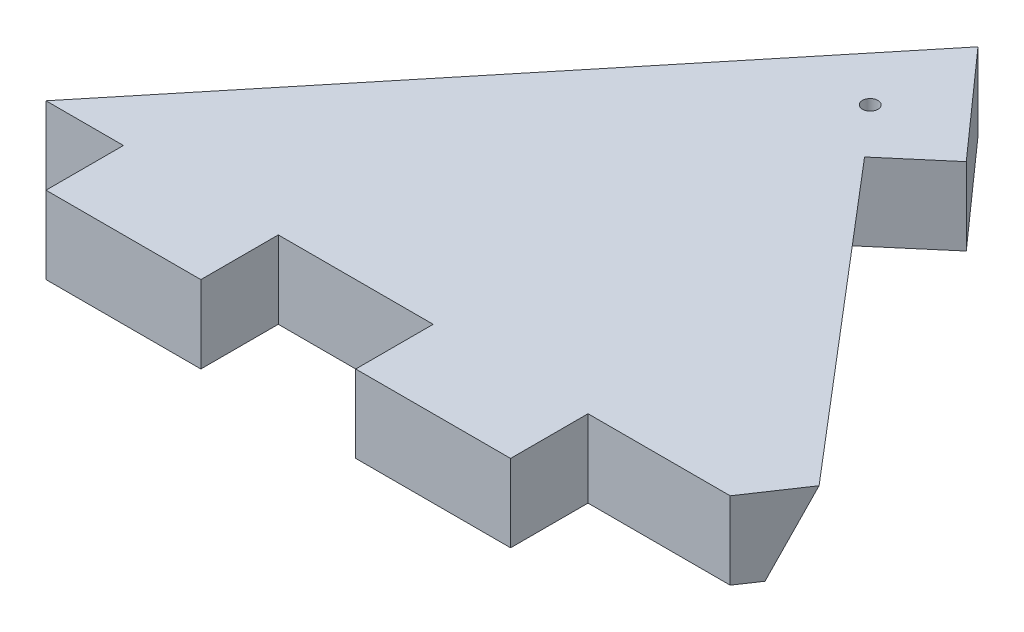
ISO-10303-21;
HEADER;
FILE_DESCRIPTION(('STEP AP214'),'2;1');
FILE_NAME('part.step','',(''),(''),'','','');
FILE_SCHEMA(('AUTOMOTIVE_DESIGN { 1 0 10303 214 1 1 1 1 }'));
ENDSEC;
DATA;
#1=APPLICATION_CONTEXT('core data for automotive mechanical design processes');
#2=APPLICATION_PROTOCOL_DEFINITION('international standard','automotive_design',2000,#1);
#3=PRODUCT_CONTEXT('',#1,'mechanical');
#4=PRODUCT('Part','Part','',(#3));
#5=PRODUCT_RELATED_PRODUCT_CATEGORY('part','',(#4));
#6=PRODUCT_DEFINITION_FORMATION('','',#4);
#7=PRODUCT_DEFINITION_CONTEXT('part definition',#1,'design');
#8=PRODUCT_DEFINITION('design','',#6,#7);
#9=PRODUCT_DEFINITION_SHAPE('','',#8);
#10=(LENGTH_UNIT() NAMED_UNIT(*) SI_UNIT(.MILLI.,.METRE.));
#11=(NAMED_UNIT(*) PLANE_ANGLE_UNIT() SI_UNIT($,.RADIAN.));
#12=(NAMED_UNIT(*) SI_UNIT($,.STERADIAN.) SOLID_ANGLE_UNIT());
#13=UNCERTAINTY_MEASURE_WITH_UNIT(LENGTH_MEASURE(1.E-05),#10,'distance_accuracy_value','');
#14=(GEOMETRIC_REPRESENTATION_CONTEXT(3) GLOBAL_UNCERTAINTY_ASSIGNED_CONTEXT((#13)) GLOBAL_UNIT_ASSIGNED_CONTEXT((#10,
#11,#12)) REPRESENTATION_CONTEXT('',''));
#15=CARTESIAN_POINT('',(0.,0.,0.));
#16=DIRECTION('',(0.,0.,1.));
#17=DIRECTION('',(1.,0.,0.));
#18=AXIS2_PLACEMENT_3D('',#15,#16,#17);
#19=CARTESIAN_POINT('',(10.0000000000253,0.,-10.));
#20=DIRECTION('',(0.,1.,0.));
#21=DIRECTION('',(0.,0.,1.));
#22=AXIS2_PLACEMENT_3D('',#19,#20,#21);
#23=PLANE('',#22);
#24=CARTESIAN_POINT('',(53.6755951689133,0.,-62.7666643876784));
#25=DIRECTION('',(0.,1.,0.));
#26=DIRECTION('',(0.,0.,1.));
#27=AXIS2_PLACEMENT_3D('',#24,#25,#26);
#28=CIRCLE('',#27,1.);
#29=CARTESIAN_POINT('',(53.6755951689133,0.,-61.7666643876784));
#30=VERTEX_POINT('',#29);
#31=EDGE_CURVE('E164',#30,#30,#28,.T.);
#32=ORIENTED_EDGE('',*,*,#31,.T.);
#33=EDGE_LOOP('',(#32));
#34=FACE_BOUND('',#33,.T.);
#35=DIRECTION('',(0.761174189576516,0.,-0.648547494885714));
#36=VECTOR('',#35,1.);
#37=CARTESIAN_POINT('',(7.67912276747319,0.,-12.7239205463367));
#38=LINE('',#37,#36);
#39=CARTESIAN_POINT('',(55.4526894768892,0.,-53.4286993412997));
#40=VERTEX_POINT('',#39);
#41=CARTESIAN_POINT('',(66.2340107176788,0.,-62.6147686773638));
#42=VERTEX_POINT('',#41);
#43=EDGE_CURVE('E143',#40,#42,#38,.T.);
#44=ORIENTED_EDGE('',*,*,#43,.F.);
#45=DIRECTION('',(-0.648547494885713,0.,-0.761174189576516));
#46=VECTOR('',#45,1.);
#47=CARTESIAN_POINT('',(57.7735667094413,0.,-50.704778794963));
#48=LINE('',#47,#46);
#49=CARTESIAN_POINT('',(90.1660580755618,0.,-12.6870105383514));
#50=VERTEX_POINT('',#49);
#51=EDGE_CURVE('E154',#50,#40,#48,.T.);
#52=ORIENTED_EDGE('',*,*,#51,.F.);
#53=DIRECTION('',(0.557648764486582,0.,-0.830077017792078));
#54=VECTOR('',#53,1.);
#55=CARTESIAN_POINT('',(88.3609146072369,0.,-10.0000000000001));
#56=LINE('',#55,#54);
#57=CARTESIAN_POINT('',(88.3609146072369,0.,-10.0000000000001));
#58=VERTEX_POINT('',#57);
#59=EDGE_CURVE('E172',#58,#50,#56,.T.);
#60=ORIENTED_EDGE('',*,*,#59,.F.);
#61=DIRECTION('',(-1.,0.,0.));
#62=VECTOR('',#61,1.);
#63=CARTESIAN_POINT('',(70.0000000000252,0.,-10.));
#64=LINE('',#63,#62);
#65=CARTESIAN_POINT('',(70.0000000000252,0.,-10.));
#66=VERTEX_POINT('',#65);
#67=EDGE_CURVE('E179',#58,#66,#64,.T.);
#68=ORIENTED_EDGE('',*,*,#67,.T.);
#69=DIRECTION('',(0.,0.,1.));
#70=VECTOR('',#69,1.);
#71=CARTESIAN_POINT('',(70.0000000000252,0.,-10.));
#72=LINE('',#71,#70);
#73=CARTESIAN_POINT('',(70.0000000000252,0.,0.));
#74=VERTEX_POINT('',#73);
#75=EDGE_CURVE('E208',#66,#74,#72,.T.);
#76=ORIENTED_EDGE('',*,*,#75,.T.);
#77=DIRECTION('',(-1.,0.,0.));
#78=VECTOR('',#77,1.);
#79=CARTESIAN_POINT('',(50.0000000000251,0.,0.));
#80=LINE('',#79,#78);
#81=CARTESIAN_POINT('',(50.0000000000251,0.,0.));
#82=VERTEX_POINT('',#81);
#83=EDGE_CURVE('E215',#74,#82,#80,.T.);
#84=ORIENTED_EDGE('',*,*,#83,.T.);
#85=DIRECTION('',(0.,0.,-1.));
#86=VECTOR('',#85,1.);
#87=CARTESIAN_POINT('',(50.0000000000251,0.,-10.));
#88=LINE('',#87,#86);
#89=CARTESIAN_POINT('',(50.0000000000251,0.,-10.));
#90=VERTEX_POINT('',#89);
#91=EDGE_CURVE('E220',#82,#90,#88,.T.);
#92=ORIENTED_EDGE('',*,*,#91,.T.);
#93=DIRECTION('',(-1.,0.,0.));
#94=VECTOR('',#93,1.);
#95=CARTESIAN_POINT('',(30.0000000000251,0.,-10.));
#96=LINE('',#95,#94);
#97=CARTESIAN_POINT('',(30.0000000000251,0.,-10.));
#98=VERTEX_POINT('',#97);
#99=EDGE_CURVE('E225',#90,#98,#96,.T.);
#100=ORIENTED_EDGE('',*,*,#99,.T.);
#101=DIRECTION('',(0.,0.,1.));
#102=VECTOR('',#101,1.);
#103=CARTESIAN_POINT('',(30.0000000000251,0.,0.));
#104=LINE('',#103,#102);
#105=CARTESIAN_POINT('',(30.0000000000251,0.,0.));
#106=VERTEX_POINT('',#105);
#107=EDGE_CURVE('E230',#98,#106,#104,.T.);
#108=ORIENTED_EDGE('',*,*,#107,.T.);
#109=DIRECTION('',(-1.,0.,0.));
#110=VECTOR('',#109,1.);
#111=CARTESIAN_POINT('',(10.0000000000252,0.,0.));
#112=LINE('',#111,#110);
#113=CARTESIAN_POINT('',(10.0000000000252,0.,0.));
#114=VERTEX_POINT('',#113);
#115=EDGE_CURVE('E235',#106,#114,#112,.T.);
#116=ORIENTED_EDGE('',*,*,#115,.T.);
#117=DIRECTION('',(0.,0.,-1.));
#118=VECTOR('',#117,1.);
#119=CARTESIAN_POINT('',(10.0000000000252,0.,0.));
#120=LINE('',#119,#118);
#121=CARTESIAN_POINT('',(10.0000000000253,0.,-10.));
#122=VERTEX_POINT('',#121);
#123=EDGE_CURVE('E240',#114,#122,#120,.T.);
#124=ORIENTED_EDGE('',*,*,#123,.T.);
#125=DIRECTION('',(-1.,0.,0.));
#126=VECTOR('',#125,1.);
#127=CARTESIAN_POINT('',(10.0000000000253,0.,-10.));
#128=LINE('',#127,#126);
#129=CARTESIAN_POINT('',(0.,0.,-10.));
#130=VERTEX_POINT('',#129);
#131=EDGE_CURVE('E245',#122,#130,#128,.T.);
#132=ORIENTED_EDGE('',*,*,#131,.T.);
#133=DIRECTION('',(0.632989399422861,0.,-0.774160461544172));
#134=VECTOR('',#133,1.);
#135=CARTESIAN_POINT('',(0.,0.,-10.));
#136=LINE('',#135,#134);
#137=CARTESIAN_POINT('',(54.1439023072188,0.,-76.2192264802171));
#138=VERTEX_POINT('',#137);
#139=EDGE_CURVE('E116',#130,#138,#136,.T.);
#140=ORIENTED_EDGE('',*,*,#139,.T.);
#141=DIRECTION('',(-0.664279644946327,0.,-0.747484149203167));
#142=VECTOR('',#141,1.);
#143=CARTESIAN_POINT('',(54.1439023072188,0.,-76.2192264802171));
#144=LINE('',#143,#142);
#145=EDGE_CURVE('E124',#42,#138,#144,.T.);
#146=ORIENTED_EDGE('',*,*,#145,.F.);
#147=EDGE_LOOP('',(#44,#52,#60,#68,#76,#84,#92,#100,#108,#116,#124,#132,#140,#146));
#148=FACE_BOUND('',#147,.T.);
#149=ADVANCED_FACE('F35',(#34,#148),#23,.F.);
#150=CARTESIAN_POINT('',(10.0000000000253,10.,-10.));
#151=DIRECTION('',(0.,1.,0.));
#152=DIRECTION('',(0.,0.,1.));
#153=AXIS2_PLACEMENT_3D('',#150,#151,#152);
#154=PLANE('',#153);
#155=CARTESIAN_POINT('',(53.6755951689133,10.,-62.7666643876784));
#156=DIRECTION('',(0.,1.,0.));
#157=DIRECTION('',(0.,0.,1.));
#158=AXIS2_PLACEMENT_3D('',#155,#156,#157);
#159=CIRCLE('',#158,0.999999999999987);
#160=CARTESIAN_POINT('',(53.6755951689133,10.,-61.7666643876784));
#161=VERTEX_POINT('',#160);
#162=EDGE_CURVE('E259',#161,#161,#159,.T.);
#163=ORIENTED_EDGE('',*,*,#162,.F.);
#164=EDGE_LOOP('',(#163));
#165=FACE_BOUND('',#164,.T.);
#166=DIRECTION('',(-0.648547494885713,0.,-0.761174189576516));
#167=VECTOR('',#166,1.);
#168=CARTESIAN_POINT('',(61.4621572570691,10.,-53.8475891951081));
#169=LINE('',#168,#167);
#170=CARTESIAN_POINT('',(92.972755186172,10.,-16.8648639037506));
#171=VERTEX_POINT('',#170);
#172=CARTESIAN_POINT('',(59.141280024517,10.,-56.5715097414448));
#173=VERTEX_POINT('',#172);
#174=EDGE_CURVE('E49',#171,#173,#169,.T.);
#175=ORIENTED_EDGE('',*,*,#174,.T.);
#176=DIRECTION('',(0.761174189576516,0.,-0.648547494885714));
#177=VECTOR('',#176,1.);
#178=CARTESIAN_POINT('',(7.67912276747319,10.,-12.7239205463367));
#179=LINE('',#178,#177);
#180=CARTESIAN_POINT('',(66.2340107176788,10.,-62.6147686773638));
#181=VERTEX_POINT('',#180);
#182=EDGE_CURVE('E160',#173,#181,#179,.T.);
#183=ORIENTED_EDGE('',*,*,#182,.T.);
#184=DIRECTION('',(-0.664279644946327,0.,-0.747484149203167));
#185=VECTOR('',#184,1.);
#186=CARTESIAN_POINT('',(54.1439023072188,10.,-76.2192264802171));
#187=LINE('',#186,#185);
#188=CARTESIAN_POINT('',(54.1439023072188,10.,-76.2192264802171));
#189=VERTEX_POINT('',#188);
#190=EDGE_CURVE('E168',#181,#189,#187,.T.);
#191=ORIENTED_EDGE('',*,*,#190,.T.);
#192=DIRECTION('',(-0.632989399422861,0.,0.774160461544172));
#193=VECTOR('',#192,1.);
#194=CARTESIAN_POINT('',(37.4699620492831,10.,-55.826617539826));
#195=LINE('',#194,#193);
#196=CARTESIAN_POINT('',(0.,10.,-10.));
#197=VERTEX_POINT('',#196);
#198=EDGE_CURVE('E205',#189,#197,#195,.T.);
#199=ORIENTED_EDGE('',*,*,#198,.T.);
#200=DIRECTION('',(1.,0.,0.));
#201=VECTOR('',#200,1.);
#202=CARTESIAN_POINT('',(10.0000000000253,10.,-10.));
#203=LINE('',#202,#201);
#204=CARTESIAN_POINT('',(10.0000000000253,10.,-10.));
#205=VERTEX_POINT('',#204);
#206=EDGE_CURVE('E202',#197,#205,#203,.T.);
#207=ORIENTED_EDGE('',*,*,#206,.T.);
#208=DIRECTION('',(0.,0.,1.));
#209=VECTOR('',#208,1.);
#210=CARTESIAN_POINT('',(10.0000000000253,10.,-10.));
#211=LINE('',#210,#209);
#212=CARTESIAN_POINT('',(10.0000000000252,10.,0.));
#213=VERTEX_POINT('',#212);
#214=EDGE_CURVE('E199',#205,#213,#211,.T.);
#215=ORIENTED_EDGE('',*,*,#214,.T.);
#216=DIRECTION('',(1.,0.,0.));
#217=VECTOR('',#216,1.);
#218=CARTESIAN_POINT('',(10.0000000000253,10.,0.));
#219=LINE('',#218,#217);
#220=CARTESIAN_POINT('',(30.0000000000251,10.,0.));
#221=VERTEX_POINT('',#220);
#222=EDGE_CURVE('E196',#213,#221,#219,.T.);
#223=ORIENTED_EDGE('',*,*,#222,.T.);
#224=DIRECTION('',(0.,0.,1.));
#225=VECTOR('',#224,1.);
#226=CARTESIAN_POINT('',(30.0000000000251,10.,-10.));
#227=LINE('',#226,#225);
#228=CARTESIAN_POINT('',(30.0000000000251,10.,-10.));
#229=VERTEX_POINT('',#228);
#230=EDGE_CURVE('E193',#221,#229,#227,.F.);
#231=ORIENTED_EDGE('',*,*,#230,.T.);
#232=DIRECTION('',(1.,0.,0.));
#233=VECTOR('',#232,1.);
#234=CARTESIAN_POINT('',(10.0000000000253,10.,-10.));
#235=LINE('',#234,#233);
#236=CARTESIAN_POINT('',(50.0000000000251,10.,-10.));
#237=VERTEX_POINT('',#236);
#238=EDGE_CURVE('E190',#229,#237,#235,.T.);
#239=ORIENTED_EDGE('',*,*,#238,.T.);
#240=DIRECTION('',(0.,0.,1.));
#241=VECTOR('',#240,1.);
#242=CARTESIAN_POINT('',(50.0000000000251,10.,-10.));
#243=LINE('',#242,#241);
#244=CARTESIAN_POINT('',(50.0000000000251,10.,0.));
#245=VERTEX_POINT('',#244);
#246=EDGE_CURVE('E187',#237,#245,#243,.T.);
#247=ORIENTED_EDGE('',*,*,#246,.T.);
#248=DIRECTION('',(1.,0.,0.));
#249=VECTOR('',#248,1.);
#250=CARTESIAN_POINT('',(10.0000000000253,10.,0.));
#251=LINE('',#250,#249);
#252=CARTESIAN_POINT('',(70.0000000000252,10.,0.));
#253=VERTEX_POINT('',#252);
#254=EDGE_CURVE('E184',#245,#253,#251,.T.);
#255=ORIENTED_EDGE('',*,*,#254,.T.);
#256=DIRECTION('',(0.,0.,1.));
#257=VECTOR('',#256,1.);
#258=CARTESIAN_POINT('',(70.0000000000252,10.,-10.));
#259=LINE('',#258,#257);
#260=CARTESIAN_POINT('',(70.0000000000252,10.,-10.));
#261=VERTEX_POINT('',#260);
#262=EDGE_CURVE('E182',#253,#261,#259,.F.);
#263=ORIENTED_EDGE('',*,*,#262,.T.);
#264=DIRECTION('',(1.,0.,0.));
#265=VECTOR('',#264,1.);
#266=CARTESIAN_POINT('',(10.0000000000253,10.,-10.));
#267=LINE('',#266,#265);
#268=CARTESIAN_POINT('',(88.3609146072369,10.,-10.0000000000001));
#269=VERTEX_POINT('',#268);
#270=EDGE_CURVE('E134',#261,#269,#267,.T.);
#271=ORIENTED_EDGE('',*,*,#270,.T.);
#272=DIRECTION('',(0.557648764486585,0.,-0.830077017792075));
#273=VECTOR('',#272,1.);
#274=CARTESIAN_POINT('',(98.9648279903557,10.,-25.784245135177));
#275=LINE('',#274,#273);
#276=EDGE_CURVE('E166',#269,#171,#275,.T.);
#277=ORIENTED_EDGE('',*,*,#276,.T.);
#278=EDGE_LOOP('',(#175,#183,#191,#199,#207,#215,#223,#231,#239,#247,#255,#263,#271,#277));
#279=FACE_BOUND('',#278,.T.);
#280=ADVANCED_FACE('F253',(#165,#279),#154,.T.);
#281=CARTESIAN_POINT('',(54.1439023072188,0.,-76.2192264802171));
#282=DIRECTION('',(0.747484149203167,0.,-0.664279644946327));
#283=DIRECTION('',(-0.664279644946327,0.,-0.747484149203167));
#284=AXIS2_PLACEMENT_3D('',#281,#282,#283);
#285=PLANE('',#284);
#286=ORIENTED_EDGE('',*,*,#190,.F.);
#287=DIRECTION('',(0.,-1.,0.));
#288=VECTOR('',#287,1.);
#289=CARTESIAN_POINT('',(66.2340107176788,0.,-62.6147686773638));
#290=LINE('',#289,#288);
#291=EDGE_CURVE('E11',#181,#42,#290,.T.);
#292=ORIENTED_EDGE('',*,*,#291,.T.);
#293=ORIENTED_EDGE('',*,*,#145,.T.);
#294=DIRECTION('',(0.,1.,0.));
#295=VECTOR('',#294,1.);
#296=CARTESIAN_POINT('',(54.1439023072188,0.,-76.2192264802171));
#297=LINE('',#296,#295);
#298=EDGE_CURVE('E177',#138,#189,#297,.T.);
#299=ORIENTED_EDGE('',*,*,#298,.T.);
#300=EDGE_LOOP('',(#286,#292,#293,#299));
#301=FACE_BOUND('',#300,.T.);
#302=ADVANCED_FACE('F266',(#301),#285,.T.);
#303=CARTESIAN_POINT('',(98.9648279903557,0.,-25.784245135177));
#304=DIRECTION('',(0.830077017792075,0.,0.557648764486585));
#305=DIRECTION('',(0.557648764486585,0.,-0.830077017792075));
#306=AXIS2_PLACEMENT_3D('',#303,#304,#305);
#307=PLANE('',#306);
#308=ORIENTED_EDGE('',*,*,#59,.T.);
#309=DIRECTION('',(0.250705897184406,0.893241726143702,-0.37318329516845));
#310=VECTOR('',#309,1.);
#311=CARTESIAN_POINT('',(91.9444585760482,6.33627509631693,-15.3342133618757));
#312=LINE('',#311,#310);
#313=EDGE_CURVE('E42',#50,#171,#312,.T.);
#314=ORIENTED_EDGE('',*,*,#313,.T.);
#315=ORIENTED_EDGE('',*,*,#276,.F.);
#316=DIRECTION('',(0.,1.,0.));
#317=VECTOR('',#316,1.);
#318=CARTESIAN_POINT('',(88.3609146072369,0.,-10.0000000000001));
#319=LINE('',#318,#317);
#320=EDGE_CURVE('E174',#58,#269,#319,.T.);
#321=ORIENTED_EDGE('',*,*,#320,.F.);
#322=EDGE_LOOP('',(#308,#314,#315,#321));
#323=FACE_BOUND('',#322,.T.);
#324=ADVANCED_FACE('F251',(#323),#307,.T.);
#325=CARTESIAN_POINT('',(70.0000000000252,10.,-10.));
#326=DIRECTION('',(0.,0.,-1.));
#327=DIRECTION('',(-1.,0.,0.));
#328=AXIS2_PLACEMENT_3D('',#325,#326,#327);
#329=PLANE('',#328);
#330=ORIENTED_EDGE('',*,*,#67,.F.);
#331=ORIENTED_EDGE('',*,*,#320,.T.);
#332=ORIENTED_EDGE('',*,*,#270,.F.);
#333=DIRECTION('',(0.,1.,0.));
#334=VECTOR('',#333,1.);
#335=CARTESIAN_POINT('',(70.0000000000252,10.,-10.));
#336=LINE('',#335,#334);
#337=EDGE_CURVE('E211',#261,#66,#336,.F.);
#338=ORIENTED_EDGE('',*,*,#337,.T.);
#339=EDGE_LOOP('',(#330,#331,#332,#338));
#340=FACE_BOUND('',#339,.T.);
#341=ADVANCED_FACE('F309',(#340),#329,.F.);
#342=CARTESIAN_POINT('',(0.,10.,-10.));
#343=DIRECTION('',(0.774160461544172,0.,0.632989399422861));
#344=DIRECTION('',(0.632989399422861,0.,-0.774160461544172));
#345=AXIS2_PLACEMENT_3D('',#342,#343,#344);
#346=PLANE('',#345);
#347=DIRECTION('',(0.,1.,0.));
#348=VECTOR('',#347,1.);
#349=CARTESIAN_POINT('',(0.,10.,-10.));
#350=LINE('',#349,#348);
#351=EDGE_CURVE('E247',#130,#197,#350,.T.);
#352=ORIENTED_EDGE('',*,*,#351,.T.);
#353=ORIENTED_EDGE('',*,*,#198,.F.);
#354=ORIENTED_EDGE('',*,*,#298,.F.);
#355=ORIENTED_EDGE('',*,*,#139,.F.);
#356=EDGE_LOOP('',(#352,#353,#354,#355));
#357=FACE_BOUND('',#356,.T.);
#358=ADVANCED_FACE('F306',(#357),#346,.F.);
#359=CARTESIAN_POINT('',(10.0000000000253,10.,-10.));
#360=DIRECTION('',(0.,0.,-1.));
#361=DIRECTION('',(-1.,0.,0.));
#362=AXIS2_PLACEMENT_3D('',#359,#360,#361);
#363=PLANE('',#362);
#364=DIRECTION('',(0.,1.,0.));
#365=VECTOR('',#364,1.);
#366=CARTESIAN_POINT('',(10.0000000000253,10.,-10.));
#367=LINE('',#366,#365);
#368=EDGE_CURVE('E243',#122,#205,#367,.T.);
#369=ORIENTED_EDGE('',*,*,#368,.T.);
#370=ORIENTED_EDGE('',*,*,#206,.F.);
#371=ORIENTED_EDGE('',*,*,#351,.F.);
#372=ORIENTED_EDGE('',*,*,#131,.F.);
#373=EDGE_LOOP('',(#369,#370,#371,#372));
#374=FACE_BOUND('',#373,.T.);
#375=ADVANCED_FACE('F302',(#374),#363,.F.);
#376=CARTESIAN_POINT('',(10.0000000000252,10.,0.));
#377=DIRECTION('',(1.,0.,0.));
#378=DIRECTION('',(0.,0.,-1.));
#379=AXIS2_PLACEMENT_3D('',#376,#377,#378);
#380=PLANE('',#379);
#381=DIRECTION('',(0.,1.,0.));
#382=VECTOR('',#381,1.);
#383=CARTESIAN_POINT('',(10.0000000000252,10.,0.));
#384=LINE('',#383,#382);
#385=EDGE_CURVE('E238',#114,#213,#384,.T.);
#386=ORIENTED_EDGE('',*,*,#385,.T.);
#387=ORIENTED_EDGE('',*,*,#214,.F.);
#388=ORIENTED_EDGE('',*,*,#368,.F.);
#389=ORIENTED_EDGE('',*,*,#123,.F.);
#390=EDGE_LOOP('',(#386,#387,#388,#389));
#391=FACE_BOUND('',#390,.T.);
#392=ADVANCED_FACE('F298',(#391),#380,.F.);
#393=CARTESIAN_POINT('',(10.0000000000252,10.,0.));
#394=DIRECTION('',(0.,0.,-1.));
#395=DIRECTION('',(-1.,0.,0.));
#396=AXIS2_PLACEMENT_3D('',#393,#394,#395);
#397=PLANE('',#396);
#398=DIRECTION('',(0.,1.,0.));
#399=VECTOR('',#398,1.);
#400=CARTESIAN_POINT('',(30.0000000000251,10.,0.));
#401=LINE('',#400,#399);
#402=EDGE_CURVE('E233',#106,#221,#401,.T.);
#403=ORIENTED_EDGE('',*,*,#402,.T.);
#404=ORIENTED_EDGE('',*,*,#222,.F.);
#405=ORIENTED_EDGE('',*,*,#385,.F.);
#406=ORIENTED_EDGE('',*,*,#115,.F.);
#407=EDGE_LOOP('',(#403,#404,#405,#406));
#408=FACE_BOUND('',#407,.T.);
#409=ADVANCED_FACE('F294',(#408),#397,.F.);
#410=CARTESIAN_POINT('',(30.0000000000251,10.,0.));
#411=DIRECTION('',(-1.,0.,0.));
#412=DIRECTION('',(0.,0.,1.));
#413=AXIS2_PLACEMENT_3D('',#410,#411,#412);
#414=PLANE('',#413);
#415=DIRECTION('',(0.,1.,0.));
#416=VECTOR('',#415,1.);
#417=CARTESIAN_POINT('',(30.0000000000251,10.,-10.));
#418=LINE('',#417,#416);
#419=EDGE_CURVE('E228',#98,#229,#418,.T.);
#420=ORIENTED_EDGE('',*,*,#419,.T.);
#421=ORIENTED_EDGE('',*,*,#230,.F.);
#422=ORIENTED_EDGE('',*,*,#402,.F.);
#423=ORIENTED_EDGE('',*,*,#107,.F.);
#424=EDGE_LOOP('',(#420,#421,#422,#423));
#425=FACE_BOUND('',#424,.T.);
#426=ADVANCED_FACE('F290',(#425),#414,.F.);
#427=CARTESIAN_POINT('',(30.0000000000251,10.,-10.));
#428=DIRECTION('',(0.,0.,-1.));
#429=DIRECTION('',(-1.,0.,0.));
#430=AXIS2_PLACEMENT_3D('',#427,#428,#429);
#431=PLANE('',#430);
#432=DIRECTION('',(0.,1.,0.));
#433=VECTOR('',#432,1.);
#434=CARTESIAN_POINT('',(50.0000000000251,10.,-10.));
#435=LINE('',#434,#433);
#436=EDGE_CURVE('E223',#90,#237,#435,.T.);
#437=ORIENTED_EDGE('',*,*,#436,.T.);
#438=ORIENTED_EDGE('',*,*,#238,.F.);
#439=ORIENTED_EDGE('',*,*,#419,.F.);
#440=ORIENTED_EDGE('',*,*,#99,.F.);
#441=EDGE_LOOP('',(#437,#438,#439,#440));
#442=FACE_BOUND('',#441,.T.);
#443=ADVANCED_FACE('F286',(#442),#431,.F.);
#444=CARTESIAN_POINT('',(50.0000000000251,10.,-10.));
#445=DIRECTION('',(1.,0.,0.));
#446=DIRECTION('',(0.,0.,-1.));
#447=AXIS2_PLACEMENT_3D('',#444,#445,#446);
#448=PLANE('',#447);
#449=DIRECTION('',(0.,1.,0.));
#450=VECTOR('',#449,1.);
#451=CARTESIAN_POINT('',(50.0000000000251,10.,0.));
#452=LINE('',#451,#450);
#453=EDGE_CURVE('E218',#82,#245,#452,.T.);
#454=ORIENTED_EDGE('',*,*,#453,.T.);
#455=ORIENTED_EDGE('',*,*,#246,.F.);
#456=ORIENTED_EDGE('',*,*,#436,.F.);
#457=ORIENTED_EDGE('',*,*,#91,.F.);
#458=EDGE_LOOP('',(#454,#455,#456,#457));
#459=FACE_BOUND('',#458,.T.);
#460=ADVANCED_FACE('F283',(#459),#448,.F.);
#461=CARTESIAN_POINT('',(50.0000000000251,10.,0.));
#462=DIRECTION('',(0.,0.,-1.));
#463=DIRECTION('',(-1.,0.,0.));
#464=AXIS2_PLACEMENT_3D('',#461,#462,#463);
#465=PLANE('',#464);
#466=DIRECTION('',(0.,1.,0.));
#467=VECTOR('',#466,1.);
#468=CARTESIAN_POINT('',(70.0000000000252,10.,0.));
#469=LINE('',#468,#467);
#470=EDGE_CURVE('E58',#74,#253,#469,.T.);
#471=ORIENTED_EDGE('',*,*,#470,.T.);
#472=ORIENTED_EDGE('',*,*,#254,.F.);
#473=ORIENTED_EDGE('',*,*,#453,.F.);
#474=ORIENTED_EDGE('',*,*,#83,.F.);
#475=EDGE_LOOP('',(#471,#472,#473,#474));
#476=FACE_BOUND('',#475,.T.);
#477=ADVANCED_FACE('F279',(#476),#465,.F.);
#478=CARTESIAN_POINT('',(70.0000000000252,10.,-10.));
#479=DIRECTION('',(-1.,0.,0.));
#480=DIRECTION('',(0.,0.,1.));
#481=AXIS2_PLACEMENT_3D('',#478,#479,#480);
#482=PLANE('',#481);
#483=ORIENTED_EDGE('',*,*,#337,.F.);
#484=ORIENTED_EDGE('',*,*,#262,.F.);
#485=ORIENTED_EDGE('',*,*,#470,.F.);
#486=ORIENTED_EDGE('',*,*,#75,.F.);
#487=EDGE_LOOP('',(#483,#484,#485,#486));
#488=FACE_BOUND('',#487,.T.);
#489=ADVANCED_FACE('F276',(#488),#482,.F.);
#490=CARTESIAN_POINT('',(83.9578576790224,8.48564351008163,-77.7161169678416));
#491=DIRECTION('',(0.648547494885714,0.,0.761174189576516));
#492=DIRECTION('',(0.761174189576516,0.,-0.648547494885714));
#493=AXIS2_PLACEMENT_3D('',#490,#491,#492);
#494=PLANE('',#493);
#495=ORIENTED_EDGE('',*,*,#43,.T.);
#496=ORIENTED_EDGE('',*,*,#291,.F.);
#497=ORIENTED_EDGE('',*,*,#182,.F.);
#498=DIRECTION('',(0.331937973150905,0.899904635293238,-0.28282296469384));
#499=VECTOR('',#498,1.);
#500=CARTESIAN_POINT('',(63.408332235058,21.5682457986162,-60.2071900621775));
#501=LINE('',#500,#499);
#502=EDGE_CURVE('E156',#40,#173,#501,.T.);
#503=ORIENTED_EDGE('',*,*,#502,.F.);
#504=EDGE_LOOP('',(#495,#496,#497,#503));
#505=FACE_BOUND('',#504,.T.);
#506=ADVANCED_FACE('F162',(#505),#494,.T.);
#507=CARTESIAN_POINT('',(47.3782014373722,-30.1627484411454,-40.3679135146366));
#508=DIRECTION('',(0.684984181465481,-0.436086742951152,-0.583630896855471));
#509=DIRECTION('',(-0.648547494885713,0.,-0.761174189576516));
#510=AXIS2_PLACEMENT_3D('',#507,#508,#509);
#511=PLANE('',#510);
#512=ORIENTED_EDGE('',*,*,#51,.T.);
#513=ORIENTED_EDGE('',*,*,#502,.T.);
#514=ORIENTED_EDGE('',*,*,#174,.F.);
#515=ORIENTED_EDGE('',*,*,#313,.F.);
#516=EDGE_LOOP('',(#512,#513,#514,#515));
#517=FACE_BOUND('',#516,.T.);
#518=ADVANCED_FACE('F155',(#517),#511,.T.);
#519=CARTESIAN_POINT('',(53.6755951689133,10.,-62.7666643876784));
#520=DIRECTION('',(0.,1.,0.));
#521=DIRECTION('',(0.,0.,1.));
#522=AXIS2_PLACEMENT_3D('',#519,#520,#521);
#523=CYLINDRICAL_SURFACE('',#522,0.999999999999994);
#524=ORIENTED_EDGE('',*,*,#31,.F.);
#525=EDGE_LOOP('',(#524));
#526=FACE_BOUND('',#525,.T.);
#527=ORIENTED_EDGE('',*,*,#162,.T.);
#528=EDGE_LOOP('',(#527));
#529=FACE_BOUND('',#528,.T.);
#530=ADVANCED_FACE('F263',(#526,#529),#523,.F.);
#531=CLOSED_SHELL('',(#149,#280,#302,#324,#341,#358,#375,#392,#409,#426,#443,#460,#477,#489,
#506,#518,#530));
#532=MANIFOLD_SOLID_BREP('B2',#531);
#533=ADVANCED_BREP_SHAPE_REPRESENTATION('',(#18,#532),#14);
#534=SHAPE_DEFINITION_REPRESENTATION(#9,#533);
ENDSEC;
END-ISO-10303-21;
